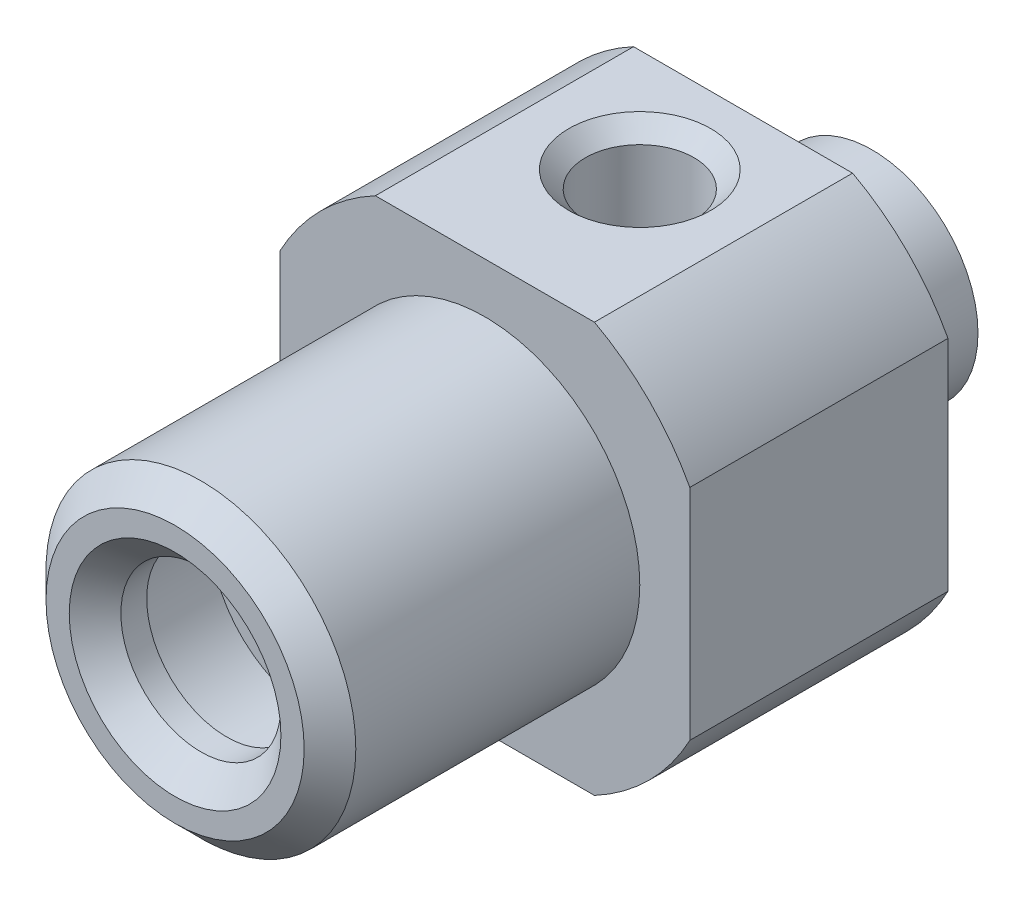
ISO-10303-21;
HEADER;
FILE_DESCRIPTION(('STEP AP214'),'2;1');
FILE_NAME('part.step','',(''),(''),'','','');
FILE_SCHEMA(('AUTOMOTIVE_DESIGN { 1 0 10303 214 1 1 1 1 }'));
ENDSEC;
DATA;
#1=APPLICATION_CONTEXT('core data for automotive mechanical design processes');
#2=APPLICATION_PROTOCOL_DEFINITION('international standard','automotive_design',2000,#1);
#3=PRODUCT_CONTEXT('',#1,'mechanical');
#4=PRODUCT('Part','Part','',(#3));
#5=PRODUCT_RELATED_PRODUCT_CATEGORY('part','',(#4));
#6=PRODUCT_DEFINITION_FORMATION('','',#4);
#7=PRODUCT_DEFINITION_CONTEXT('part definition',#1,'design');
#8=PRODUCT_DEFINITION('design','',#6,#7);
#9=PRODUCT_DEFINITION_SHAPE('','',#8);
#10=(LENGTH_UNIT() NAMED_UNIT(*) SI_UNIT(.MILLI.,.METRE.));
#11=(NAMED_UNIT(*) PLANE_ANGLE_UNIT() SI_UNIT($,.RADIAN.));
#12=(NAMED_UNIT(*) SI_UNIT($,.STERADIAN.) SOLID_ANGLE_UNIT());
#13=UNCERTAINTY_MEASURE_WITH_UNIT(LENGTH_MEASURE(1.E-05),#10,'distance_accuracy_value','');
#14=(GEOMETRIC_REPRESENTATION_CONTEXT(3) GLOBAL_UNCERTAINTY_ASSIGNED_CONTEXT((#13)) GLOBAL_UNIT_ASSIGNED_CONTEXT((#10,
#11,#12)) REPRESENTATION_CONTEXT('',''));
#15=CARTESIAN_POINT('',(0.,0.,0.));
#16=DIRECTION('',(0.,0.,1.));
#17=DIRECTION('',(1.,0.,0.));
#18=AXIS2_PLACEMENT_3D('',#15,#16,#17);
#19=CARTESIAN_POINT('',(0.,6.,1.5));
#20=DIRECTION('',(0.,0.,-1.));
#21=DIRECTION('',(-1.,0.,0.));
#22=AXIS2_PLACEMENT_3D('',#19,#20,#21);
#23=PLANE('',#22);
#24=CARTESIAN_POINT('',(0.,0.,1.5));
#25=DIRECTION('',(0.,0.,1.));
#26=DIRECTION('',(1.,0.,0.));
#27=AXIS2_PLACEMENT_3D('',#24,#25,#26);
#28=CIRCLE('',#27,6.);
#29=CARTESIAN_POINT('',(6.,0.,1.5));
#30=VERTEX_POINT('',#29);
#31=EDGE_CURVE('E237',#30,#30,#28,.T.);
#32=ORIENTED_EDGE('',*,*,#31,.F.);
#33=EDGE_LOOP('',(#32));
#34=FACE_BOUND('',#33,.T.);
#35=CARTESIAN_POINT('',(0.,0.,1.5));
#36=DIRECTION('',(0.,0.,1.));
#37=DIRECTION('',(1.,0.,0.));
#38=AXIS2_PLACEMENT_3D('',#35,#36,#37);
#39=CIRCLE('',#38,9.);
#40=CARTESIAN_POINT('',(7.9375,4.24218030616332,1.5));
#41=VERTEX_POINT('',#40);
#42=CARTESIAN_POINT('',(4.24218030616333,7.9375,1.5));
#43=VERTEX_POINT('',#42);
#44=EDGE_CURVE('E240',#41,#43,#39,.T.);
#45=ORIENTED_EDGE('',*,*,#44,.T.);
#46=DIRECTION('',(1.,0.,0.));
#47=VECTOR('',#46,1.);
#48=CARTESIAN_POINT('',(0.,7.9375,1.5));
#49=LINE('',#48,#47);
#50=CARTESIAN_POINT('',(-4.24218030616333,7.9375,1.5));
#51=VERTEX_POINT('',#50);
#52=EDGE_CURVE('E277',#51,#43,#49,.T.);
#53=ORIENTED_EDGE('',*,*,#52,.F.);
#54=CARTESIAN_POINT('',(-7.9375,4.24218030616333,1.5));
#55=VERTEX_POINT('',#54);
#56=EDGE_CURVE('E243',#51,#55,#39,.T.);
#57=ORIENTED_EDGE('',*,*,#56,.T.);
#58=DIRECTION('',(0.,1.,0.));
#59=VECTOR('',#58,1.);
#60=CARTESIAN_POINT('',(-7.9375,0.,1.5));
#61=LINE('',#60,#59);
#62=CARTESIAN_POINT('',(-7.9375,-4.24218030616333,1.5));
#63=VERTEX_POINT('',#62);
#64=EDGE_CURVE('E278',#63,#55,#61,.T.);
#65=ORIENTED_EDGE('',*,*,#64,.F.);
#66=CARTESIAN_POINT('',(-4.24218030616332,-7.9375,1.5));
#67=VERTEX_POINT('',#66);
#68=EDGE_CURVE('E349',#63,#67,#39,.T.);
#69=ORIENTED_EDGE('',*,*,#68,.T.);
#70=DIRECTION('',(1.,0.,0.));
#71=VECTOR('',#70,1.);
#72=CARTESIAN_POINT('',(0.,-7.9375,1.5));
#73=LINE('',#72,#71);
#74=CARTESIAN_POINT('',(4.24218030616332,-7.9375,1.5));
#75=VERTEX_POINT('',#74);
#76=EDGE_CURVE('E280',#67,#75,#73,.T.);
#77=ORIENTED_EDGE('',*,*,#76,.T.);
#78=CARTESIAN_POINT('',(7.9375,-4.24218030616333,1.5));
#79=VERTEX_POINT('',#78);
#80=EDGE_CURVE('E244',#75,#79,#39,.T.);
#81=ORIENTED_EDGE('',*,*,#80,.T.);
#82=DIRECTION('',(0.,1.,0.));
#83=VECTOR('',#82,1.);
#84=CARTESIAN_POINT('',(7.9375,0.,1.5));
#85=LINE('',#84,#83);
#86=EDGE_CURVE('E293',#79,#41,#85,.T.);
#87=ORIENTED_EDGE('',*,*,#86,.T.);
#88=EDGE_LOOP('',(#45,#53,#57,#65,#69,#77,#81,#87));
#89=FACE_BOUND('',#88,.T.);
#90=ADVANCED_FACE('F40',(#34,#89),#23,.F.);
#91=CARTESIAN_POINT('',(0.,0.,0.));
#92=DIRECTION('',(0.,0.,1.));
#93=DIRECTION('',(1.,0.,0.));
#94=AXIS2_PLACEMENT_3D('',#91,#92,#93);
#95=CYLINDRICAL_SURFACE('',#94,9.);
#96=CARTESIAN_POINT('',(0.,0.,-8.5));
#97=DIRECTION('',(0.,0.,1.));
#98=DIRECTION('',(1.,0.,0.));
#99=AXIS2_PLACEMENT_3D('',#96,#97,#98);
#100=CIRCLE('',#99,9.);
#101=CARTESIAN_POINT('',(7.9375,4.24218030616332,-8.5));
#102=VERTEX_POINT('',#101);
#103=CARTESIAN_POINT('',(4.24218030616333,7.9375,-8.5));
#104=VERTEX_POINT('',#103);
#105=EDGE_CURVE('E245',#102,#104,#100,.T.);
#106=ORIENTED_EDGE('',*,*,#105,.T.);
#107=DIRECTION('',(0.,0.,-1.));
#108=VECTOR('',#107,1.);
#109=CARTESIAN_POINT('',(4.24218030616333,7.9375,13.501));
#110=LINE('',#109,#108);
#111=EDGE_CURVE('E309',#43,#104,#110,.T.);
#112=ORIENTED_EDGE('',*,*,#111,.F.);
#113=ORIENTED_EDGE('',*,*,#44,.F.);
#114=DIRECTION('',(0.,0.,-1.));
#115=VECTOR('',#114,1.);
#116=CARTESIAN_POINT('',(7.9375,4.24218030616332,13.501));
#117=LINE('',#116,#115);
#118=EDGE_CURVE('E298',#41,#102,#117,.T.);
#119=ORIENTED_EDGE('',*,*,#118,.T.);
#120=EDGE_LOOP('',(#106,#112,#113,#119));
#121=FACE_BOUND('',#120,.T.);
#122=ADVANCED_FACE('F190',(#121),#95,.T.);
#123=ORIENTED_EDGE('',*,*,#56,.F.);
#124=DIRECTION('',(0.,0.,-1.));
#125=VECTOR('',#124,1.);
#126=CARTESIAN_POINT('',(-4.24218030616333,7.9375,13.501));
#127=LINE('',#126,#125);
#128=CARTESIAN_POINT('',(-4.24218030616333,7.9375,-8.5));
#129=VERTEX_POINT('',#128);
#130=EDGE_CURVE('E308',#51,#129,#127,.T.);
#131=ORIENTED_EDGE('',*,*,#130,.T.);
#132=CARTESIAN_POINT('',(-7.9375,4.24218030616333,-8.5));
#133=VERTEX_POINT('',#132);
#134=EDGE_CURVE('E248',#129,#133,#100,.T.);
#135=ORIENTED_EDGE('',*,*,#134,.T.);
#136=DIRECTION('',(0.,0.,-1.));
#137=VECTOR('',#136,1.);
#138=CARTESIAN_POINT('',(-7.9375,4.24218030616333,13.501));
#139=LINE('',#138,#137);
#140=EDGE_CURVE('E282',#55,#133,#139,.T.);
#141=ORIENTED_EDGE('',*,*,#140,.F.);
#142=EDGE_LOOP('',(#123,#131,#135,#141));
#143=FACE_BOUND('',#142,.T.);
#144=ADVANCED_FACE('F196',(#143),#95,.T.);
#145=DIRECTION('',(0.,0.,-1.));
#146=VECTOR('',#145,1.);
#147=CARTESIAN_POINT('',(7.9375,-4.24218030616333,13.501));
#148=LINE('',#147,#146);
#149=CARTESIAN_POINT('',(7.9375,-4.24218030616333,-8.5));
#150=VERTEX_POINT('',#149);
#151=EDGE_CURVE('E69',#79,#150,#148,.T.);
#152=ORIENTED_EDGE('',*,*,#151,.F.);
#153=ORIENTED_EDGE('',*,*,#80,.F.);
#154=DIRECTION('',(0.,0.,-1.));
#155=VECTOR('',#154,1.);
#156=CARTESIAN_POINT('',(4.24218030616332,-7.9375,13.501));
#157=LINE('',#156,#155);
#158=CARTESIAN_POINT('',(4.24218030616332,-7.9375,-8.5));
#159=VERTEX_POINT('',#158);
#160=EDGE_CURVE('E287',#75,#159,#157,.T.);
#161=ORIENTED_EDGE('',*,*,#160,.T.);
#162=EDGE_CURVE('E249',#159,#150,#100,.T.);
#163=ORIENTED_EDGE('',*,*,#162,.T.);
#164=EDGE_LOOP('',(#152,#153,#161,#163));
#165=FACE_BOUND('',#164,.T.);
#166=ADVANCED_FACE('F333',(#165),#95,.T.);
#167=DIRECTION('',(0.,0.,-1.));
#168=VECTOR('',#167,1.);
#169=CARTESIAN_POINT('',(-4.24218030616332,-7.9375,13.501));
#170=LINE('',#169,#168);
#171=CARTESIAN_POINT('',(-4.24218030616332,-7.9375,-8.5));
#172=VERTEX_POINT('',#171);
#173=EDGE_CURVE('E290',#67,#172,#170,.T.);
#174=ORIENTED_EDGE('',*,*,#173,.F.);
#175=ORIENTED_EDGE('',*,*,#68,.F.);
#176=DIRECTION('',(0.,0.,-1.));
#177=VECTOR('',#176,1.);
#178=CARTESIAN_POINT('',(-7.9375,-4.24218030616333,13.501));
#179=LINE('',#178,#177);
#180=CARTESIAN_POINT('',(-7.9375,-4.24218030616333,-8.5));
#181=VERTEX_POINT('',#180);
#182=EDGE_CURVE('E281',#63,#181,#179,.T.);
#183=ORIENTED_EDGE('',*,*,#182,.T.);
#184=EDGE_CURVE('E336',#181,#172,#100,.T.);
#185=ORIENTED_EDGE('',*,*,#184,.T.);
#186=EDGE_LOOP('',(#174,#175,#183,#185));
#187=FACE_BOUND('',#186,.T.);
#188=ADVANCED_FACE('F199',(#187),#95,.T.);
#189=CARTESIAN_POINT('',(0.,9.,-8.5));
#190=DIRECTION('',(0.,0.,1.));
#191=DIRECTION('',(1.,0.,0.));
#192=AXIS2_PLACEMENT_3D('',#189,#190,#191);
#193=PLANE('',#192);
#194=CARTESIAN_POINT('',(0.,0.,-8.5));
#195=DIRECTION('',(0.,0.,1.));
#196=DIRECTION('',(1.,0.,0.));
#197=AXIS2_PLACEMENT_3D('',#194,#195,#196);
#198=CIRCLE('',#197,4.75);
#199=CARTESIAN_POINT('',(4.75,0.,-8.5));
#200=VERTEX_POINT('',#199);
#201=EDGE_CURVE('E250',#200,#200,#198,.T.);
#202=ORIENTED_EDGE('',*,*,#201,.T.);
#203=EDGE_LOOP('',(#202));
#204=FACE_BOUND('',#203,.T.);
#205=ORIENTED_EDGE('',*,*,#134,.F.);
#206=DIRECTION('',(-1.,0.,0.));
#207=VECTOR('',#206,1.);
#208=CARTESIAN_POINT('',(0.,7.9375,-8.5));
#209=LINE('',#208,#207);
#210=EDGE_CURVE('E303',#104,#129,#209,.T.);
#211=ORIENTED_EDGE('',*,*,#210,.F.);
#212=ORIENTED_EDGE('',*,*,#105,.F.);
#213=DIRECTION('',(0.,-1.,0.));
#214=VECTOR('',#213,1.);
#215=CARTESIAN_POINT('',(7.9375,0.,-8.5));
#216=LINE('',#215,#214);
#217=EDGE_CURVE('E301',#102,#150,#216,.T.);
#218=ORIENTED_EDGE('',*,*,#217,.T.);
#219=ORIENTED_EDGE('',*,*,#162,.F.);
#220=DIRECTION('',(-1.,0.,0.));
#221=VECTOR('',#220,1.);
#222=CARTESIAN_POINT('',(0.,-7.9375,-8.5));
#223=LINE('',#222,#221);
#224=EDGE_CURVE('E291',#159,#172,#223,.T.);
#225=ORIENTED_EDGE('',*,*,#224,.T.);
#226=ORIENTED_EDGE('',*,*,#184,.F.);
#227=DIRECTION('',(0.,-1.,0.));
#228=VECTOR('',#227,1.);
#229=CARTESIAN_POINT('',(-7.9375,0.,-8.5));
#230=LINE('',#229,#228);
#231=EDGE_CURVE('E130',#133,#181,#230,.T.);
#232=ORIENTED_EDGE('',*,*,#231,.F.);
#233=EDGE_LOOP('',(#205,#211,#212,#218,#219,#225,#226,#232));
#234=FACE_BOUND('',#233,.T.);
#235=ADVANCED_FACE('F222',(#204,#234),#193,.F.);
#236=CARTESIAN_POINT('',(0.,0.,0.));
#237=DIRECTION('',(0.,0.,1.));
#238=DIRECTION('',(1.,0.,0.));
#239=AXIS2_PLACEMENT_3D('',#236,#237,#238);
#240=CYLINDRICAL_SURFACE('',#239,3.1);
#241=CARTESIAN_POINT('',(0.,0.,11.5));
#242=DIRECTION('',(0.,0.,1.));
#243=DIRECTION('',(1.,0.,0.));
#244=AXIS2_PLACEMENT_3D('',#241,#242,#243);
#245=CIRCLE('',#244,3.1);
#246=CARTESIAN_POINT('',(3.1,0.,11.5));
#247=VERTEX_POINT('',#246);
#248=EDGE_CURVE('E274',#247,#247,#245,.T.);
#249=ORIENTED_EDGE('',*,*,#248,.F.);
#250=EDGE_LOOP('',(#249));
#251=FACE_BOUND('',#250,.T.);
#252=CARTESIAN_POINT('',(0.,0.,12.5));
#253=DIRECTION('',(0.,0.,1.));
#254=DIRECTION('',(1.,0.,0.));
#255=AXIS2_PLACEMENT_3D('',#252,#253,#254);
#256=CIRCLE('',#255,3.1);
#257=CARTESIAN_POINT('',(3.1,0.,12.5));
#258=VERTEX_POINT('',#257);
#259=EDGE_CURVE('E143',#258,#258,#256,.T.);
#260=ORIENTED_EDGE('',*,*,#259,.T.);
#261=EDGE_LOOP('',(#260));
#262=FACE_BOUND('',#261,.T.);
#263=ADVANCED_FACE('F42',(#251,#262),#240,.F.);
#264=CARTESIAN_POINT('',(0.,0.,13.5));
#265=DIRECTION('',(0.,0.,1.));
#266=DIRECTION('',(1.,0.,0.));
#267=AXIS2_PLACEMENT_3D('',#264,#265,#266);
#268=CONICAL_SURFACE('',#267,4.10000000000001,0.78539816339745);
#269=ORIENTED_EDGE('',*,*,#259,.F.);
#270=EDGE_LOOP('',(#269));
#271=FACE_BOUND('',#270,.T.);
#272=CARTESIAN_POINT('',(0.,0.,13.5));
#273=DIRECTION('',(0.,0.,1.));
#274=DIRECTION('',(1.,0.,0.));
#275=AXIS2_PLACEMENT_3D('',#272,#273,#274);
#276=CIRCLE('',#275,4.10000000000001);
#277=CARTESIAN_POINT('',(4.10000000000001,0.,13.5));
#278=VERTEX_POINT('',#277);
#279=EDGE_CURVE('E229',#278,#278,#276,.T.);
#280=ORIENTED_EDGE('',*,*,#279,.T.);
#281=EDGE_LOOP('',(#280));
#282=FACE_BOUND('',#281,.T.);
#283=ADVANCED_FACE('F215',(#271,#282),#268,.F.);
#284=CARTESIAN_POINT('',(0.,4.10000000000001,13.5));
#285=DIRECTION('',(0.,0.,-1.));
#286=DIRECTION('',(-1.,0.,0.));
#287=AXIS2_PLACEMENT_3D('',#284,#285,#286);
#288=PLANE('',#287);
#289=ORIENTED_EDGE('',*,*,#279,.F.);
#290=EDGE_LOOP('',(#289));
#291=FACE_BOUND('',#290,.T.);
#292=CARTESIAN_POINT('',(0.,0.,13.5));
#293=DIRECTION('',(0.,0.,1.));
#294=DIRECTION('',(1.,0.,0.));
#295=AXIS2_PLACEMENT_3D('',#292,#293,#294);
#296=CIRCLE('',#295,5.);
#297=CARTESIAN_POINT('',(5.,0.,13.5));
#298=VERTEX_POINT('',#297);
#299=EDGE_CURVE('E230',#298,#298,#296,.T.);
#300=ORIENTED_EDGE('',*,*,#299,.T.);
#301=EDGE_LOOP('',(#300));
#302=FACE_BOUND('',#301,.T.);
#303=ADVANCED_FACE('F212',(#291,#302),#288,.F.);
#304=CARTESIAN_POINT('',(0.,0.,12.5));
#305=DIRECTION('',(0.,0.,-1.));
#306=DIRECTION('',(-1.,0.,0.));
#307=AXIS2_PLACEMENT_3D('',#304,#305,#306);
#308=CONICAL_SURFACE('',#307,6.,0.785398163397447);
#309=ORIENTED_EDGE('',*,*,#299,.F.);
#310=EDGE_LOOP('',(#309));
#311=FACE_BOUND('',#310,.T.);
#312=CARTESIAN_POINT('',(0.,0.,12.5));
#313=DIRECTION('',(0.,0.,1.));
#314=DIRECTION('',(1.,0.,0.));
#315=AXIS2_PLACEMENT_3D('',#312,#313,#314);
#316=CIRCLE('',#315,6.);
#317=CARTESIAN_POINT('',(6.,0.,12.5));
#318=VERTEX_POINT('',#317);
#319=EDGE_CURVE('E232',#318,#318,#316,.T.);
#320=ORIENTED_EDGE('',*,*,#319,.T.);
#321=EDGE_LOOP('',(#320));
#322=FACE_BOUND('',#321,.T.);
#323=ADVANCED_FACE('F208',(#311,#322),#308,.T.);
#324=CARTESIAN_POINT('',(0.,0.,0.));
#325=DIRECTION('',(0.,0.,1.));
#326=DIRECTION('',(1.,0.,0.));
#327=AXIS2_PLACEMENT_3D('',#324,#325,#326);
#328=CYLINDRICAL_SURFACE('',#327,6.);
#329=ORIENTED_EDGE('',*,*,#319,.F.);
#330=EDGE_LOOP('',(#329));
#331=FACE_BOUND('',#330,.T.);
#332=ORIENTED_EDGE('',*,*,#31,.T.);
#333=EDGE_LOOP('',(#332));
#334=FACE_BOUND('',#333,.T.);
#335=ADVANCED_FACE('F204',(#331,#334),#328,.T.);
#336=CARTESIAN_POINT('',(0.,0.,0.));
#337=DIRECTION('',(0.,0.,1.));
#338=DIRECTION('',(1.,0.,0.));
#339=AXIS2_PLACEMENT_3D('',#336,#337,#338);
#340=CYLINDRICAL_SURFACE('',#339,4.75);
#341=ORIENTED_EDGE('',*,*,#201,.F.);
#342=EDGE_LOOP('',(#341));
#343=FACE_BOUND('',#342,.T.);
#344=CARTESIAN_POINT('',(0.,0.,-9.85));
#345=DIRECTION('',(0.,0.,1.));
#346=DIRECTION('',(1.,0.,0.));
#347=AXIS2_PLACEMENT_3D('',#344,#345,#346);
#348=CIRCLE('',#347,4.75);
#349=CARTESIAN_POINT('',(4.75,0.,-9.85));
#350=VERTEX_POINT('',#349);
#351=EDGE_CURVE('E253',#350,#350,#348,.T.);
#352=ORIENTED_EDGE('',*,*,#351,.T.);
#353=EDGE_LOOP('',(#352));
#354=FACE_BOUND('',#353,.T.);
#355=ADVANCED_FACE('F207',(#343,#354),#340,.T.);
#356=CARTESIAN_POINT('',(0.,4.75,-9.85));
#357=DIRECTION('',(0.,0.,1.));
#358=DIRECTION('',(1.,0.,0.));
#359=AXIS2_PLACEMENT_3D('',#356,#357,#358);
#360=PLANE('',#359);
#361=ORIENTED_EDGE('',*,*,#351,.F.);
#362=EDGE_LOOP('',(#361));
#363=FACE_BOUND('',#362,.T.);
#364=CARTESIAN_POINT('',(0.,0.,-9.85));
#365=DIRECTION('',(0.,0.,1.));
#366=DIRECTION('',(1.,0.,0.));
#367=AXIS2_PLACEMENT_3D('',#364,#365,#366);
#368=CIRCLE('',#367,4.1);
#369=CARTESIAN_POINT('',(4.1,0.,-9.85));
#370=VERTEX_POINT('',#369);
#371=EDGE_CURVE('E256',#370,#370,#368,.T.);
#372=ORIENTED_EDGE('',*,*,#371,.T.);
#373=EDGE_LOOP('',(#372));
#374=FACE_BOUND('',#373,.T.);
#375=ADVANCED_FACE('F406',(#363,#374),#360,.F.);
#376=CARTESIAN_POINT('',(0.,0.,0.));
#377=DIRECTION('',(0.,0.,1.));
#378=DIRECTION('',(1.,0.,0.));
#379=AXIS2_PLACEMENT_3D('',#376,#377,#378);
#380=CYLINDRICAL_SURFACE('',#379,4.1);
#381=ORIENTED_EDGE('',*,*,#371,.F.);
#382=EDGE_LOOP('',(#381));
#383=FACE_BOUND('',#382,.T.);
#384=CARTESIAN_POINT('',(0.,0.,-13.5));
#385=DIRECTION('',(0.,0.,1.));
#386=DIRECTION('',(1.,0.,0.));
#387=AXIS2_PLACEMENT_3D('',#384,#385,#386);
#388=CIRCLE('',#387,4.1);
#389=CARTESIAN_POINT('',(4.1,0.,-13.5));
#390=VERTEX_POINT('',#389);
#391=EDGE_CURVE('E259',#390,#390,#388,.T.);
#392=ORIENTED_EDGE('',*,*,#391,.T.);
#393=EDGE_LOOP('',(#392));
#394=FACE_BOUND('',#393,.T.);
#395=ADVANCED_FACE('F397',(#383,#394),#380,.T.);
#396=CARTESIAN_POINT('',(0.,4.1,-13.5));
#397=DIRECTION('',(0.,0.,1.));
#398=DIRECTION('',(1.,0.,0.));
#399=AXIS2_PLACEMENT_3D('',#396,#397,#398);
#400=PLANE('',#399);
#401=ORIENTED_EDGE('',*,*,#391,.F.);
#402=EDGE_LOOP('',(#401));
#403=FACE_BOUND('',#402,.T.);
#404=CARTESIAN_POINT('',(0.,0.,-13.5));
#405=DIRECTION('',(0.,0.,1.));
#406=DIRECTION('',(1.,0.,0.));
#407=AXIS2_PLACEMENT_3D('',#404,#405,#406);
#408=CIRCLE('',#407,2.25);
#409=CARTESIAN_POINT('',(2.25,0.,-13.5));
#410=VERTEX_POINT('',#409);
#411=EDGE_CURVE('E262',#410,#410,#408,.T.);
#412=ORIENTED_EDGE('',*,*,#411,.T.);
#413=EDGE_LOOP('',(#412));
#414=FACE_BOUND('',#413,.T.);
#415=ADVANCED_FACE('F186',(#403,#414),#400,.F.);
#416=CARTESIAN_POINT('',(0.,0.,0.));
#417=DIRECTION('',(0.,0.,1.));
#418=DIRECTION('',(1.,0.,0.));
#419=AXIS2_PLACEMENT_3D('',#416,#417,#418);
#420=CYLINDRICAL_SURFACE('',#419,2.25);
#421=DIRECTION('',(0.,0.,1.));
#422=VECTOR('',#421,1.);
#423=CARTESIAN_POINT('',(2.04538352149419,0.937500000000003,0.));
#424=LINE('',#423,#422);
#425=CARTESIAN_POINT('',(2.04538352149419,0.937500000000006,-4.02417834223314));
#426=VERTEX_POINT('',#425);
#427=CARTESIAN_POINT('',(2.04538352149419,0.937500000000006,-4.97582165776682));
#428=VERTEX_POINT('',#427);
#429=EDGE_CURVE('E54',#426,#428,#424,.F.);
#430=ORIENTED_EDGE('',*,*,#429,.T.);
#431=CARTESIAN_POINT('',(2.04538352149419,0.937500000000006,-4.97582165776685));
#432=CARTESIAN_POINT('',(2.03769506876895,0.954285861893541,-5.0088463481007));
#433=CARTESIAN_POINT('',(2.02932820666342,0.971983336024863,-5.04121484970983));
#434=CARTESIAN_POINT('',(2.01130714332788,1.008740263602,-5.10476331754226));
#435=CARTESIAN_POINT('',(2.00165410062062,1.02779848427243,-5.13594432127476));
#436=CARTESIAN_POINT('',(1.97088830893697,1.0862935597974,-5.22785535289002));
#437=CARTESIAN_POINT('',(1.94793765157081,1.12712150560826,-5.28708421190127));
#438=CARTESIAN_POINT('',(1.89717333000401,1.21063847915185,-5.40262630277086));
#439=CARTESIAN_POINT('',(1.86933031076587,1.25333750178561,-5.45891911190074));
#440=CARTESIAN_POINT('',(1.80886201479935,1.33913259820842,-5.56861663767527));
#441=CARTESIAN_POINT('',(1.77623401948123,1.38222888457199,-5.62201968873061));
#442=CARTESIAN_POINT('',(1.70638893708213,1.46756716551144,-5.72560413656642));
#443=CARTESIAN_POINT('',(1.66920889565588,1.50981317445065,-5.77580706772242));
#444=CARTESIAN_POINT('',(1.58998104486053,1.59303727882719,-5.87328351900989));
#445=CARTESIAN_POINT('',(1.54793383415681,1.63401552941562,-5.92055739832101));
#446=CARTESIAN_POINT('',(1.41446819544071,1.7538581160714,-6.05739298208148));
#447=CARTESIAN_POINT('',(1.31547126409139,1.82995396979926,-6.14235253661036));
#448=CARTESIAN_POINT('',(1.1290761117621,1.94835285027546,-6.27315776483378));
#449=CARTESIAN_POINT('',(1.04673487122654,1.99403447051162,-6.32318003428906));
#450=CARTESIAN_POINT('',(0.872264541033667,2.07627771379797,-6.41278587478176));
#451=CARTESIAN_POINT('',(0.780139899124074,2.11284345602951,-6.4523741610755));
#452=CARTESIAN_POINT('',(0.58661909215988,2.17457658690596,-6.51901987808489));
#453=CARTESIAN_POINT('',(0.485139265309949,2.19962607570369,-6.54594775613417));
#454=CARTESIAN_POINT('',(0.276866743481708,2.23538767402996,-6.58434847563899));
#455=CARTESIAN_POINT('',(0.170080840473331,2.24611764645433,-6.595840572592));
#456=CARTESIAN_POINT('',(-0.0283452807846901,2.25167712156069,-6.60179666388817));
#457=CARTESIAN_POINT('',(-0.119867929244496,2.24864025756947,-6.59854557887685));
#458=CARTESIAN_POINT('',(-0.300697409309738,2.231663838865,-6.58034479968534));
#459=CARTESIAN_POINT('',(-0.390004184364244,2.2177240061936,-6.56539480725548));
#460=CARTESIAN_POINT('',(-0.560609153143667,2.18072397807296,-6.52561298852541));
#461=CARTESIAN_POINT('',(-0.642082799948599,2.1580312059448,-6.50117903943971));
#462=CARTESIAN_POINT('',(-0.799228292446634,2.10490467662864,-6.44376992615126));
#463=CARTESIAN_POINT('',(-0.874899106023678,2.07446954648959,-6.41079324704859));
#464=CARTESIAN_POINT('',(-1.05136343632204,1.99256010550127,-6.32160179627656));
#465=CARTESIAN_POINT('',(-1.14864426060331,1.93770935479381,-6.26153504190506));
#466=CARTESIAN_POINT('',(-1.32897308738269,1.81880665925042,-6.12983822607349));
#467=CARTESIAN_POINT('',(-1.41197352484435,1.75472522283874,-6.05817100728664));
#468=CARTESIAN_POINT('',(-1.53801524600702,1.64361853057092,-5.93162790699897));
#469=CARTESIAN_POINT('',(-1.58507154312854,1.59816362295841,-5.87928147974168));
#470=CARTESIAN_POINT('',(-1.67314889401385,1.50570486426786,-5.77100144564314));
#471=CARTESIAN_POINT('',(-1.71417015702764,1.45870106696297,-5.71506796327085));
#472=CARTESIAN_POINT('',(-1.79024222866635,1.36425728625974,-5.5999037079485));
#473=CARTESIAN_POINT('',(-1.82530625920745,1.31681852179624,-5.54068063465119));
#474=CARTESIAN_POINT('',(-1.88965371276692,1.2226838723372,-5.41867446537074));
#475=CARTESIAN_POINT('',(-1.91894095178551,1.17598751579914,-5.35589375499855));
#476=CARTESIAN_POINT('',(-1.96553368767488,1.09580003068807,-5.24132814500062));
#477=CARTESIAN_POINT('',(-1.984038794767,1.06177811096043,-5.19041278931911));
#478=CARTESIAN_POINT('',(-2.0174521143053,0.996879331063774,-5.08554588811934));
#479=CARTESIAN_POINT('',(-2.03236180896044,0.966001177920633,-5.03159560510132));
#480=CARTESIAN_POINT('',(-2.04538352149419,0.937500000000006,-4.97582165776685));
#481=B_SPLINE_CURVE_WITH_KNOTS('',3,(#431,#432,#433,#434,#435,#436,#437,#438,#439,#440,#441,
#442,#443,#444,#445,#446,#447,#448,#449,#450,#451,#452,#453,#454,#455,#456,#457,#458,#459,#460,
#461,#462,#463,#464,#465,#466,#467,#468,#469,#470,#471,#472,#473,#474,#475,#476,#477,#478,#479,
#480),.UNSPECIFIED.,.F.,.F.,(4,2,2,2,2,2,2,2,2,2,2,2,2,2,2,2,2,2,2,2,2,2,2,2,4),(0.,
0.113437255512295,0.226773014978205,0.452990990141825,0.680615796940032,0.908370433691744,
1.13438142123065,1.3603646387339,1.81065980834888,2.1294402489059,2.44807638034924,
2.76990569574004,3.09133316836749,3.36480013622895,3.63827407603087,3.90133665442205,
4.16444591421376,4.54279348146345,4.92237782528216,5.17345455709219,5.42452258137927,
5.67502587340892,5.92536313109941,6.11705422731367,6.30866616324749),.UNSPECIFIED.);
#482=CARTESIAN_POINT('',(-2.04538352149419,0.937500000000006,-4.97582165776682));
#483=VERTEX_POINT('',#482);
#484=EDGE_CURVE('E11',#428,#483,#481,.T.);
#485=ORIENTED_EDGE('',*,*,#484,.T.);
#486=DIRECTION('',(0.,0.,1.));
#487=VECTOR('',#486,1.);
#488=CARTESIAN_POINT('',(-2.04538352149419,0.937500000000003,0.));
#489=LINE('',#488,#487);
#490=CARTESIAN_POINT('',(-2.04538352149419,0.937500000000006,-4.02417834223317));
#491=VERTEX_POINT('',#490);
#492=EDGE_CURVE('E135',#483,#491,#489,.T.);
#493=ORIENTED_EDGE('',*,*,#492,.T.);
#494=CARTESIAN_POINT('',(-2.04538352149419,0.937500000000006,-4.02417834223315));
#495=CARTESIAN_POINT('',(-2.03769506876895,0.954285861893541,-3.9911536518993));
#496=CARTESIAN_POINT('',(-2.02932820666342,0.971983336024862,-3.95878515029016));
#497=CARTESIAN_POINT('',(-2.01130714332788,1.008740263602,-3.89523668245774));
#498=CARTESIAN_POINT('',(-2.00165410062062,1.02779848427243,-3.86405567872523));
#499=CARTESIAN_POINT('',(-1.97088830893697,1.0862935597974,-3.77214464710998));
#500=CARTESIAN_POINT('',(-1.94793765157081,1.12712150560826,-3.71291578809873));
#501=CARTESIAN_POINT('',(-1.89717333000401,1.21063847915185,-3.59737369722914));
#502=CARTESIAN_POINT('',(-1.86933031076587,1.2533375017856,-3.54108088809926));
#503=CARTESIAN_POINT('',(-1.80886201479936,1.33913259820842,-3.43138336232473));
#504=CARTESIAN_POINT('',(-1.77623401948123,1.38222888457199,-3.37798031126939));
#505=CARTESIAN_POINT('',(-1.70638893708214,1.46756716551144,-3.27439586343358));
#506=CARTESIAN_POINT('',(-1.66920889565588,1.50981317445065,-3.22419293227758));
#507=CARTESIAN_POINT('',(-1.58998104486054,1.59303727882718,-3.12671648099011));
#508=CARTESIAN_POINT('',(-1.54793383415682,1.63401552941561,-3.07944260167899));
#509=CARTESIAN_POINT('',(-1.41446819544072,1.75385811607139,-2.94260701791853));
#510=CARTESIAN_POINT('',(-1.3154712640914,1.82995396979925,-2.85764746338964));
#511=CARTESIAN_POINT('',(-1.12907611176212,1.94835285027545,-2.72684223516622));
#512=CARTESIAN_POINT('',(-1.04673487122655,1.99403447051162,-2.67681996571094));
#513=CARTESIAN_POINT('',(-0.872264541033678,2.07627771379797,-2.58721412521824));
#514=CARTESIAN_POINT('',(-0.780139899124085,2.11284345602951,-2.5476258389245));
#515=CARTESIAN_POINT('',(-0.586619092159891,2.17457658690595,-2.48098012191511));
#516=CARTESIAN_POINT('',(-0.48513926530996,2.19962607570369,-2.45405224386583));
#517=CARTESIAN_POINT('',(-0.276866743481718,2.23538767402995,-2.41565152436101));
#518=CARTESIAN_POINT('',(-0.170080840473341,2.24611764645433,-2.40415942740799));
#519=CARTESIAN_POINT('',(0.0283452807846814,2.25167712156069,-2.39820333611183));
#520=CARTESIAN_POINT('',(0.119867929244488,2.24864025756947,-2.40145442112314));
#521=CARTESIAN_POINT('',(0.30069740930973,2.231663838865,-2.41965520031465));
#522=CARTESIAN_POINT('',(0.390004184364236,2.2177240061936,-2.43460519274451));
#523=CARTESIAN_POINT('',(0.560609153143659,2.18072397807296,-2.47438701147458));
#524=CARTESIAN_POINT('',(0.642082799948592,2.1580312059448,-2.49882096056028));
#525=CARTESIAN_POINT('',(0.799228292446627,2.10490467662864,-2.55623007384873));
#526=CARTESIAN_POINT('',(0.874899106023671,2.0744695464896,-2.5892067529514));
#527=CARTESIAN_POINT('',(1.05136343632204,1.99256010550128,-2.67839820372343));
#528=CARTESIAN_POINT('',(1.1486442606033,1.93770935479381,-2.73846495809493));
#529=CARTESIAN_POINT('',(1.32897308738268,1.81880665925042,-2.87016177392649));
#530=CARTESIAN_POINT('',(1.41197352484434,1.75472522283874,-2.94182899271335));
#531=CARTESIAN_POINT('',(1.53801524600701,1.64361853057093,-3.06837209300101));
#532=CARTESIAN_POINT('',(1.58507154312854,1.59816362295842,-3.12071852025831));
#533=CARTESIAN_POINT('',(1.67314889401384,1.50570486426787,-3.22899855435684));
#534=CARTESIAN_POINT('',(1.71417015702764,1.45870106696298,-3.28493203672913));
#535=CARTESIAN_POINT('',(1.79024222866634,1.36425728625975,-3.40009629205149));
#536=CARTESIAN_POINT('',(1.82530625920745,1.31681852179625,-3.45931936534879));
#537=CARTESIAN_POINT('',(1.88965371276691,1.22268387233721,-3.58132553462924));
#538=CARTESIAN_POINT('',(1.91894095178551,1.17598751579914,-3.64410624500143));
#539=CARTESIAN_POINT('',(1.96553368767487,1.09580003068807,-3.75867185499937));
#540=CARTESIAN_POINT('',(1.984038794767,1.06177811096044,-3.80958721068088));
#541=CARTESIAN_POINT('',(2.0174521143053,0.996879331063776,-3.91445411188065));
#542=CARTESIAN_POINT('',(2.03236180896044,0.966001177920634,-3.96840439489867));
#543=CARTESIAN_POINT('',(2.04538352149419,0.937500000000006,-4.02417834223314));
#544=B_SPLINE_CURVE_WITH_KNOTS('',3,(#494,#495,#496,#497,#498,#499,#500,#501,#502,#503,#504,
#505,#506,#507,#508,#509,#510,#511,#512,#513,#514,#515,#516,#517,#518,#519,#520,#521,#522,#523,
#524,#525,#526,#527,#528,#529,#530,#531,#532,#533,#534,#535,#536,#537,#538,#539,#540,#541,#542,
#543),.UNSPECIFIED.,.F.,.F.,(4,2,2,2,2,2,2,2,2,2,2,2,2,2,2,2,2,2,2,2,2,2,2,2,4),(0.,
0.113437255512294,0.226773014978202,0.452990990141823,0.680615796940028,0.908370433691739,
1.13438142123064,1.36036463873389,1.81065980834887,2.12944024890589,2.44807638034923,
2.76990569574003,3.09133316836748,3.36480013622894,3.63827407603087,3.90133665442205,
4.16444591421375,4.54279348146344,4.92237782528215,5.17345455709218,5.42452258137926,
5.67502587340891,5.9253631310994,6.11705422731367,6.30866616324749),.UNSPECIFIED.);
#545=EDGE_CURVE('E134',#491,#426,#544,.T.);
#546=ORIENTED_EDGE('',*,*,#545,.T.);
#547=EDGE_LOOP('',(#430,#485,#493,#546));
#548=FACE_BOUND('',#547,.T.);
#549=ORIENTED_EDGE('',*,*,#411,.F.);
#550=EDGE_LOOP('',(#549));
#551=FACE_BOUND('',#550,.T.);
#552=CARTESIAN_POINT('',(0.,0.,8.));
#553=DIRECTION('',(0.,0.,1.));
#554=DIRECTION('',(1.,0.,0.));
#555=AXIS2_PLACEMENT_3D('',#552,#553,#554);
#556=CIRCLE('',#555,2.25);
#557=CARTESIAN_POINT('',(2.25,0.,8.));
#558=VERTEX_POINT('',#557);
#559=EDGE_CURVE('E265',#558,#558,#556,.T.);
#560=ORIENTED_EDGE('',*,*,#559,.T.);
#561=EDGE_LOOP('',(#560));
#562=FACE_BOUND('',#561,.T.);
#563=ADVANCED_FACE('F132',(#548,#551,#562),#420,.F.);
#564=CARTESIAN_POINT('',(0.,4.15,8.));
#565=DIRECTION('',(0.,0.,-1.));
#566=DIRECTION('',(-1.,0.,0.));
#567=AXIS2_PLACEMENT_3D('',#564,#565,#566);
#568=PLANE('',#567);
#569=ORIENTED_EDGE('',*,*,#559,.F.);
#570=EDGE_LOOP('',(#569));
#571=FACE_BOUND('',#570,.T.);
#572=CARTESIAN_POINT('',(0.,0.,8.));
#573=DIRECTION('',(0.,0.,1.));
#574=DIRECTION('',(1.,0.,0.));
#575=AXIS2_PLACEMENT_3D('',#572,#573,#574);
#576=CIRCLE('',#575,4.15);
#577=CARTESIAN_POINT('',(4.15,0.,8.));
#578=VERTEX_POINT('',#577);
#579=EDGE_CURVE('E268',#578,#578,#576,.T.);
#580=ORIENTED_EDGE('',*,*,#579,.T.);
#581=EDGE_LOOP('',(#580));
#582=FACE_BOUND('',#581,.T.);
#583=ADVANCED_FACE('F179',(#571,#582),#568,.F.);
#584=CARTESIAN_POINT('',(0.,0.,0.));
#585=DIRECTION('',(0.,0.,1.));
#586=DIRECTION('',(1.,0.,0.));
#587=AXIS2_PLACEMENT_3D('',#584,#585,#586);
#588=CYLINDRICAL_SURFACE('',#587,4.15);
#589=ORIENTED_EDGE('',*,*,#579,.F.);
#590=EDGE_LOOP('',(#589));
#591=FACE_BOUND('',#590,.T.);
#592=CARTESIAN_POINT('',(0.,0.,11.5));
#593=DIRECTION('',(0.,0.,1.));
#594=DIRECTION('',(1.,0.,0.));
#595=AXIS2_PLACEMENT_3D('',#592,#593,#594);
#596=CIRCLE('',#595,4.15);
#597=CARTESIAN_POINT('',(4.15,0.,11.5));
#598=VERTEX_POINT('',#597);
#599=EDGE_CURVE('E271',#598,#598,#596,.T.);
#600=ORIENTED_EDGE('',*,*,#599,.T.);
#601=EDGE_LOOP('',(#600));
#602=FACE_BOUND('',#601,.T.);
#603=ADVANCED_FACE('F176',(#591,#602),#588,.F.);
#604=CARTESIAN_POINT('',(0.,3.1,11.5));
#605=DIRECTION('',(0.,0.,1.));
#606=DIRECTION('',(1.,0.,0.));
#607=AXIS2_PLACEMENT_3D('',#604,#605,#606);
#608=PLANE('',#607);
#609=ORIENTED_EDGE('',*,*,#599,.F.);
#610=EDGE_LOOP('',(#609));
#611=FACE_BOUND('',#610,.T.);
#612=ORIENTED_EDGE('',*,*,#248,.T.);
#613=EDGE_LOOP('',(#612));
#614=FACE_BOUND('',#613,.T.);
#615=ADVANCED_FACE('F172',(#611,#614),#608,.F.);
#616=CARTESIAN_POINT('',(-7.9375,0.,13.501));
#617=DIRECTION('',(1.,0.,0.));
#618=DIRECTION('',(0.,0.,-1.));
#619=AXIS2_PLACEMENT_3D('',#616,#617,#618);
#620=PLANE('',#619);
#621=ORIENTED_EDGE('',*,*,#64,.T.);
#622=ORIENTED_EDGE('',*,*,#140,.T.);
#623=ORIENTED_EDGE('',*,*,#231,.T.);
#624=ORIENTED_EDGE('',*,*,#182,.F.);
#625=EDGE_LOOP('',(#621,#622,#623,#624));
#626=FACE_BOUND('',#625,.T.);
#627=ADVANCED_FACE('F168',(#626),#620,.F.);
#628=CARTESIAN_POINT('',(0.,-7.9375,13.501));
#629=DIRECTION('',(0.,-1.,0.));
#630=DIRECTION('',(0.,0.,-1.));
#631=AXIS2_PLACEMENT_3D('',#628,#629,#630);
#632=PLANE('',#631);
#633=ORIENTED_EDGE('',*,*,#173,.T.);
#634=ORIENTED_EDGE('',*,*,#224,.F.);
#635=ORIENTED_EDGE('',*,*,#160,.F.);
#636=ORIENTED_EDGE('',*,*,#76,.F.);
#637=EDGE_LOOP('',(#633,#634,#635,#636));
#638=FACE_BOUND('',#637,.T.);
#639=ADVANCED_FACE('F165',(#638),#632,.T.);
#640=CARTESIAN_POINT('',(7.9375,0.,13.501));
#641=DIRECTION('',(1.,0.,0.));
#642=DIRECTION('',(0.,1.,0.));
#643=AXIS2_PLACEMENT_3D('',#640,#641,#642);
#644=PLANE('',#643);
#645=ORIENTED_EDGE('',*,*,#151,.T.);
#646=ORIENTED_EDGE('',*,*,#217,.F.);
#647=ORIENTED_EDGE('',*,*,#118,.F.);
#648=ORIENTED_EDGE('',*,*,#86,.F.);
#649=EDGE_LOOP('',(#645,#646,#647,#648));
#650=FACE_BOUND('',#649,.T.);
#651=ADVANCED_FACE('F161',(#650),#644,.T.);
#652=CARTESIAN_POINT('',(0.,7.9375,13.501));
#653=DIRECTION('',(0.,-1.,0.));
#654=DIRECTION('',(0.,0.,-1.));
#655=AXIS2_PLACEMENT_3D('',#652,#653,#654);
#656=PLANE('',#655);
#657=CARTESIAN_POINT('',(0.,7.9375,-4.5));
#658=DIRECTION('',(0.,1.,0.));
#659=DIRECTION('',(0.,0.,1.));
#660=AXIS2_PLACEMENT_3D('',#657,#658,#659);
#661=CIRCLE('',#660,2.75);
#662=CARTESIAN_POINT('',(0.,7.9375,-1.75));
#663=VERTEX_POINT('',#662);
#664=EDGE_CURVE('E317',#663,#663,#661,.T.);
#665=ORIENTED_EDGE('',*,*,#664,.F.);
#666=EDGE_LOOP('',(#665));
#667=FACE_BOUND('',#666,.T.);
#668=ORIENTED_EDGE('',*,*,#52,.T.);
#669=ORIENTED_EDGE('',*,*,#111,.T.);
#670=ORIENTED_EDGE('',*,*,#210,.T.);
#671=ORIENTED_EDGE('',*,*,#130,.F.);
#672=EDGE_LOOP('',(#668,#669,#670,#671));
#673=FACE_BOUND('',#672,.T.);
#674=ADVANCED_FACE('F158',(#667,#673),#656,.F.);
#675=CARTESIAN_POINT('',(0.,0.937500000000003,-4.5));
#676=DIRECTION('',(0.,-1.,0.));
#677=DIRECTION('',(0.,0.,-1.));
#678=AXIS2_PLACEMENT_3D('',#675,#676,#677);
#679=PLANE('',#678);
#680=CARTESIAN_POINT('',(0.,0.937500000000006,-4.5));
#681=DIRECTION('',(0.,1.,0.));
#682=DIRECTION('',(0.,0.,1.));
#683=AXIS2_PLACEMENT_3D('',#680,#681,#682);
#684=CIRCLE('',#683,2.09999999999999);
#685=EDGE_CURVE('E61',#426,#428,#684,.T.);
#686=ORIENTED_EDGE('',*,*,#685,.T.);
#687=ORIENTED_EDGE('',*,*,#429,.F.);
#688=EDGE_LOOP('',(#686,#687));
#689=FACE_BOUND('',#688,.T.);
#690=ADVANCED_FACE('F128',(#689),#679,.F.);
#691=EDGE_CURVE('E123',#483,#491,#684,.T.);
#692=ORIENTED_EDGE('',*,*,#691,.T.);
#693=ORIENTED_EDGE('',*,*,#492,.F.);
#694=EDGE_LOOP('',(#692,#693));
#695=FACE_BOUND('',#694,.T.);
#696=ADVANCED_FACE('F153',(#695),#679,.F.);
#697=CARTESIAN_POINT('',(0.,7.9375,-4.5));
#698=DIRECTION('',(0.,1.,0.));
#699=DIRECTION('',(0.,0.,1.));
#700=AXIS2_PLACEMENT_3D('',#697,#698,#699);
#701=CYLINDRICAL_SURFACE('',#700,2.09999999999999);
#702=CARTESIAN_POINT('',(0.,7.2875,-4.5));
#703=DIRECTION('',(0.,1.,0.));
#704=DIRECTION('',(0.,0.,1.));
#705=AXIS2_PLACEMENT_3D('',#702,#703,#704);
#706=CIRCLE('',#705,2.1);
#707=CARTESIAN_POINT('',(0.,7.2875,-2.4));
#708=VERTEX_POINT('',#707);
#709=EDGE_CURVE('E314',#708,#708,#706,.T.);
#710=ORIENTED_EDGE('',*,*,#709,.T.);
#711=EDGE_LOOP('',(#710));
#712=FACE_BOUND('',#711,.T.);
#713=ORIENTED_EDGE('',*,*,#685,.F.);
#714=ORIENTED_EDGE('',*,*,#545,.F.);
#715=ORIENTED_EDGE('',*,*,#691,.F.);
#716=ORIENTED_EDGE('',*,*,#484,.F.);
#717=EDGE_LOOP('',(#713,#714,#715,#716));
#718=FACE_BOUND('',#717,.T.);
#719=ADVANCED_FACE('F121',(#712,#718),#701,.F.);
#720=CARTESIAN_POINT('',(0.,7.9375,-4.5));
#721=DIRECTION('',(0.,1.,0.));
#722=DIRECTION('',(0.,0.,1.));
#723=AXIS2_PLACEMENT_3D('',#720,#721,#722);
#724=CONICAL_SURFACE('',#723,2.75,0.785398163397449);
#725=ORIENTED_EDGE('',*,*,#709,.F.);
#726=EDGE_LOOP('',(#725));
#727=FACE_BOUND('',#726,.T.);
#728=ORIENTED_EDGE('',*,*,#664,.T.);
#729=EDGE_LOOP('',(#728));
#730=FACE_BOUND('',#729,.T.);
#731=ADVANCED_FACE('F152',(#727,#730),#724,.F.);
#732=CLOSED_SHELL('',(#90,#122,#144,#166,#188,#235,#263,#283,#303,#323,#335,#355,#375,#395,#415,
#563,#583,#603,#615,#627,#639,#651,#674,#690,#696,#719,#731));
#733=MANIFOLD_SOLID_BREP('B2',#732);
#734=ADVANCED_BREP_SHAPE_REPRESENTATION('',(#18,#733),#14);
#735=SHAPE_DEFINITION_REPRESENTATION(#9,#734);
ENDSEC;
END-ISO-10303-21;
